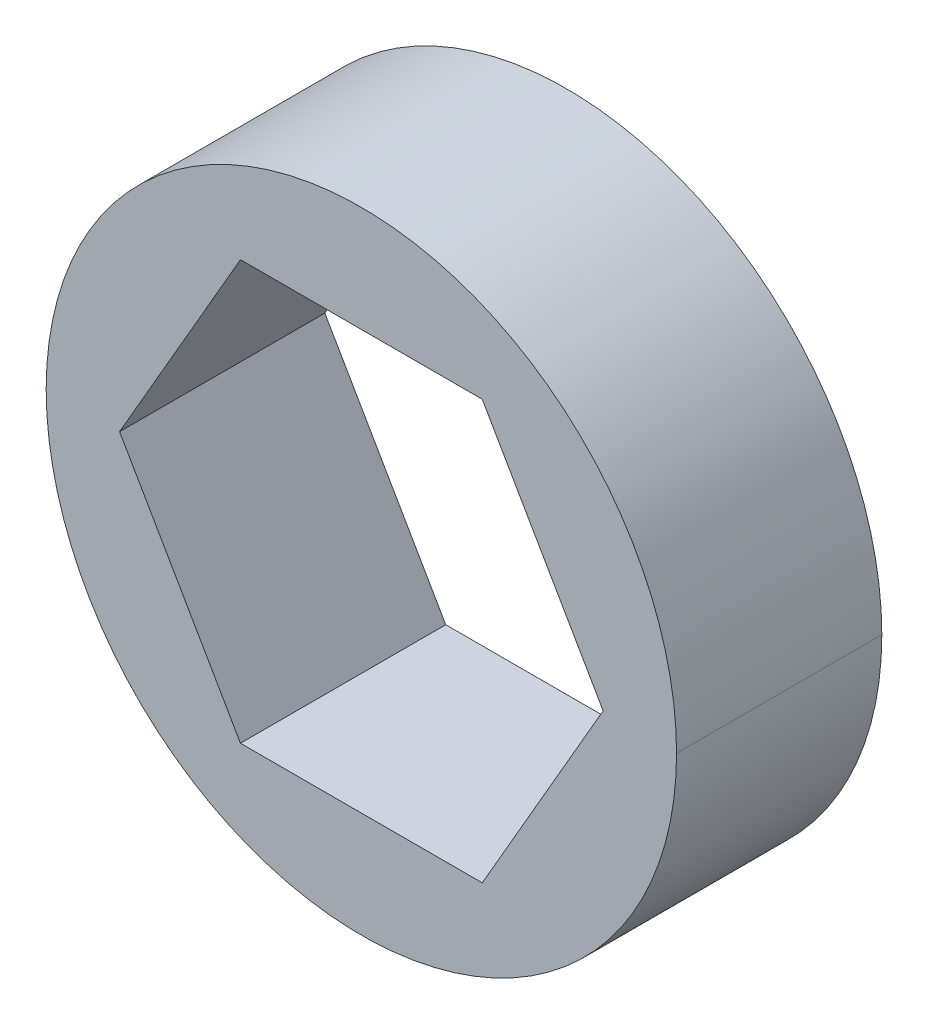
ISO-10303-21;
HEADER;
FILE_DESCRIPTION(('STEP AP214'),'2;1');
FILE_NAME('part.step','',(''),(''),'','','');
FILE_SCHEMA(('AUTOMOTIVE_DESIGN { 1 0 10303 214 1 1 1 1 }'));
ENDSEC;
DATA;
#1=APPLICATION_CONTEXT('core data for automotive mechanical design processes');
#2=APPLICATION_PROTOCOL_DEFINITION('international standard','automotive_design',2000,#1);
#3=PRODUCT_CONTEXT('',#1,'mechanical');
#4=PRODUCT('Part','Part','',(#3));
#5=PRODUCT_RELATED_PRODUCT_CATEGORY('part','',(#4));
#6=PRODUCT_DEFINITION_FORMATION('','',#4);
#7=PRODUCT_DEFINITION_CONTEXT('part definition',#1,'design');
#8=PRODUCT_DEFINITION('design','',#6,#7);
#9=PRODUCT_DEFINITION_SHAPE('','',#8);
#10=(LENGTH_UNIT() NAMED_UNIT(*) SI_UNIT(.MILLI.,.METRE.));
#11=(NAMED_UNIT(*) PLANE_ANGLE_UNIT() SI_UNIT($,.RADIAN.));
#12=(NAMED_UNIT(*) SI_UNIT($,.STERADIAN.) SOLID_ANGLE_UNIT());
#13=UNCERTAINTY_MEASURE_WITH_UNIT(LENGTH_MEASURE(1.E-05),#10,'distance_accuracy_value','');
#14=(GEOMETRIC_REPRESENTATION_CONTEXT(3) GLOBAL_UNCERTAINTY_ASSIGNED_CONTEXT((#13)) GLOBAL_UNIT_ASSIGNED_CONTEXT((#10,
#11,#12)) REPRESENTATION_CONTEXT('',''));
#15=CARTESIAN_POINT('',(0.,0.,0.));
#16=DIRECTION('',(0.,0.,1.));
#17=DIRECTION('',(1.,0.,0.));
#18=AXIS2_PLACEMENT_3D('',#15,#16,#17);
#19=CARTESIAN_POINT('',(-7.47899538708241,0.,3.175));
#20=DIRECTION('',(0.866025403784439,0.5,0.));
#21=DIRECTION('',(0.,0.,-1.));
#22=AXIS2_PLACEMENT_3D('',#19,#20,#21);
#23=PLANE('',#22);
#24=DIRECTION('',(-0.5,0.866025403784439,0.));
#25=VECTOR('',#24,1.);
#26=CARTESIAN_POINT('',(-3.7394976935412,-6.477,3.175));
#27=LINE('',#26,#25);
#28=CARTESIAN_POINT('',(-3.7394976935412,-6.477,3.175));
#29=VERTEX_POINT('',#28);
#30=CARTESIAN_POINT('',(-7.47899538708241,0.,3.175));
#31=VERTEX_POINT('',#30);
#32=EDGE_CURVE('E165',#29,#31,#27,.T.);
#33=ORIENTED_EDGE('',*,*,#32,.F.);
#34=DIRECTION('',(0.,0.,1.));
#35=VECTOR('',#34,1.);
#36=CARTESIAN_POINT('',(-3.73949769354121,-6.477,3.175));
#37=LINE('',#36,#35);
#38=CARTESIAN_POINT('',(-3.7394976935412,-6.477,-3.175));
#39=VERTEX_POINT('',#38);
#40=EDGE_CURVE('E158',#39,#29,#37,.T.);
#41=ORIENTED_EDGE('',*,*,#40,.F.);
#42=DIRECTION('',(-0.5,0.866025403784439,0.));
#43=VECTOR('',#42,1.);
#44=CARTESIAN_POINT('',(-3.73949769354121,-6.477,-3.175));
#45=LINE('',#44,#43);
#46=CARTESIAN_POINT('',(-7.47899538708241,0.,-3.175));
#47=VERTEX_POINT('',#46);
#48=EDGE_CURVE('E177',#39,#47,#45,.T.);
#49=ORIENTED_EDGE('',*,*,#48,.T.);
#50=DIRECTION('',(0.,0.,-1.));
#51=VECTOR('',#50,1.);
#52=CARTESIAN_POINT('',(-7.47899538708241,0.,3.175));
#53=LINE('',#52,#51);
#54=EDGE_CURVE('E11',#31,#47,#53,.T.);
#55=ORIENTED_EDGE('',*,*,#54,.F.);
#56=EDGE_LOOP('',(#33,#41,#49,#55));
#57=FACE_BOUND('',#56,.T.);
#58=ADVANCED_FACE('F16',(#57),#23,.T.);
#59=CARTESIAN_POINT('',(-3.73949769354121,6.477,3.175));
#60=DIRECTION('',(0.866025403784439,-0.5,0.));
#61=DIRECTION('',(0.,0.,-1.));
#62=AXIS2_PLACEMENT_3D('',#59,#60,#61);
#63=PLANE('',#62);
#64=DIRECTION('',(0.5,0.866025403784439,0.));
#65=VECTOR('',#64,1.);
#66=CARTESIAN_POINT('',(-7.47899538708242,0.,3.175));
#67=LINE('',#66,#65);
#68=CARTESIAN_POINT('',(-3.73949769354121,6.477,3.175));
#69=VERTEX_POINT('',#68);
#70=EDGE_CURVE('E164',#31,#69,#67,.T.);
#71=ORIENTED_EDGE('',*,*,#70,.F.);
#72=ORIENTED_EDGE('',*,*,#54,.T.);
#73=DIRECTION('',(0.5,0.866025403784439,0.));
#74=VECTOR('',#73,1.);
#75=CARTESIAN_POINT('',(-7.47899538708241,0.,-3.175));
#76=LINE('',#75,#74);
#77=CARTESIAN_POINT('',(-3.73949769354121,6.477,-3.175));
#78=VERTEX_POINT('',#77);
#79=EDGE_CURVE('E20',#47,#78,#76,.T.);
#80=ORIENTED_EDGE('',*,*,#79,.T.);
#81=DIRECTION('',(0.,0.,-1.));
#82=VECTOR('',#81,1.);
#83=CARTESIAN_POINT('',(-3.73949769354121,6.477,3.175));
#84=LINE('',#83,#82);
#85=EDGE_CURVE('E27',#69,#78,#84,.T.);
#86=ORIENTED_EDGE('',*,*,#85,.F.);
#87=EDGE_LOOP('',(#71,#72,#80,#86));
#88=FACE_BOUND('',#87,.T.);
#89=ADVANCED_FACE('F289',(#88),#63,.T.);
#90=CARTESIAN_POINT('',(3.7394976935412,6.477,3.175));
#91=DIRECTION('',(0.,-1.,0.));
#92=DIRECTION('',(0.,0.,-1.));
#93=AXIS2_PLACEMENT_3D('',#90,#91,#92);
#94=PLANE('',#93);
#95=DIRECTION('',(1.,0.,0.));
#96=VECTOR('',#95,1.);
#97=CARTESIAN_POINT('',(0.,6.477,3.175));
#98=LINE('',#97,#96);
#99=CARTESIAN_POINT('',(3.7394976935412,6.477,3.175));
#100=VERTEX_POINT('',#99);
#101=EDGE_CURVE('E153',#69,#100,#98,.T.);
#102=ORIENTED_EDGE('',*,*,#101,.F.);
#103=ORIENTED_EDGE('',*,*,#85,.T.);
#104=DIRECTION('',(1.,0.,0.));
#105=VECTOR('',#104,1.);
#106=CARTESIAN_POINT('',(0.,6.477,-3.175));
#107=LINE('',#106,#105);
#108=CARTESIAN_POINT('',(3.7394976935412,6.477,-3.175));
#109=VERTEX_POINT('',#108);
#110=EDGE_CURVE('E181',#78,#109,#107,.T.);
#111=ORIENTED_EDGE('',*,*,#110,.T.);
#112=DIRECTION('',(0.,0.,-1.));
#113=VECTOR('',#112,1.);
#114=CARTESIAN_POINT('',(3.7394976935412,6.477,3.175));
#115=LINE('',#114,#113);
#116=EDGE_CURVE('E73',#100,#109,#115,.T.);
#117=ORIENTED_EDGE('',*,*,#116,.F.);
#118=EDGE_LOOP('',(#102,#103,#111,#117));
#119=FACE_BOUND('',#118,.T.);
#120=ADVANCED_FACE('F296',(#119),#94,.T.);
#121=CARTESIAN_POINT('',(7.47899538708241,0.,3.175));
#122=DIRECTION('',(-0.866025403784439,-0.5,0.));
#123=DIRECTION('',(-0.5,0.866025403784439,0.));
#124=AXIS2_PLACEMENT_3D('',#121,#122,#123);
#125=PLANE('',#124);
#126=DIRECTION('',(0.5,-0.866025403784439,0.));
#127=VECTOR('',#126,1.);
#128=CARTESIAN_POINT('',(3.7394976935412,6.477,3.175));
#129=LINE('',#128,#127);
#130=CARTESIAN_POINT('',(7.47899538708242,0.,3.175));
#131=VERTEX_POINT('',#130);
#132=EDGE_CURVE('E148',#100,#131,#129,.T.);
#133=ORIENTED_EDGE('',*,*,#132,.F.);
#134=ORIENTED_EDGE('',*,*,#116,.T.);
#135=DIRECTION('',(0.5,-0.866025403784439,0.));
#136=VECTOR('',#135,1.);
#137=CARTESIAN_POINT('',(3.7394976935412,6.477,-3.175));
#138=LINE('',#137,#136);
#139=CARTESIAN_POINT('',(7.47899538708241,0.,-3.175));
#140=VERTEX_POINT('',#139);
#141=EDGE_CURVE('E183',#109,#140,#138,.T.);
#142=ORIENTED_EDGE('',*,*,#141,.T.);
#143=DIRECTION('',(0.,0.,-1.));
#144=VECTOR('',#143,1.);
#145=CARTESIAN_POINT('',(7.47899538708242,0.,3.175));
#146=LINE('',#145,#144);
#147=EDGE_CURVE('E110',#131,#140,#146,.T.);
#148=ORIENTED_EDGE('',*,*,#147,.F.);
#149=EDGE_LOOP('',(#133,#134,#142,#148));
#150=FACE_BOUND('',#149,.T.);
#151=ADVANCED_FACE('F301',(#150),#125,.T.);
#152=CARTESIAN_POINT('',(3.7394976935412,-6.477,3.175));
#153=DIRECTION('',(-0.866025403784439,0.5,0.));
#154=DIRECTION('',(0.,0.,1.));
#155=AXIS2_PLACEMENT_3D('',#152,#153,#154);
#156=PLANE('',#155);
#157=DIRECTION('',(-0.5,-0.866025403784439,0.));
#158=VECTOR('',#157,1.);
#159=CARTESIAN_POINT('',(7.47899538708241,0.,3.175));
#160=LINE('',#159,#158);
#161=CARTESIAN_POINT('',(3.73949769354121,-6.477,3.175));
#162=VERTEX_POINT('',#161);
#163=EDGE_CURVE('E152',#131,#162,#160,.T.);
#164=ORIENTED_EDGE('',*,*,#163,.F.);
#165=ORIENTED_EDGE('',*,*,#147,.T.);
#166=DIRECTION('',(-0.5,-0.866025403784439,0.));
#167=VECTOR('',#166,1.);
#168=CARTESIAN_POINT('',(7.47899538708241,0.,-3.175));
#169=LINE('',#168,#167);
#170=CARTESIAN_POINT('',(3.73949769354121,-6.477,-3.175));
#171=VERTEX_POINT('',#170);
#172=EDGE_CURVE('E127',#140,#171,#169,.T.);
#173=ORIENTED_EDGE('',*,*,#172,.T.);
#174=DIRECTION('',(0.,0.,-1.));
#175=VECTOR('',#174,1.);
#176=CARTESIAN_POINT('',(3.7394976935412,-6.477,3.175));
#177=LINE('',#176,#175);
#178=EDGE_CURVE('E161',#162,#171,#177,.T.);
#179=ORIENTED_EDGE('',*,*,#178,.F.);
#180=EDGE_LOOP('',(#164,#165,#173,#179));
#181=FACE_BOUND('',#180,.T.);
#182=ADVANCED_FACE('F329',(#181),#156,.T.);
#183=CARTESIAN_POINT('',(-3.7394976935412,-6.477,3.175));
#184=DIRECTION('',(0.,1.,0.));
#185=DIRECTION('',(1.,0.,0.));
#186=AXIS2_PLACEMENT_3D('',#183,#184,#185);
#187=PLANE('',#186);
#188=DIRECTION('',(-1.,0.,0.));
#189=VECTOR('',#188,1.);
#190=CARTESIAN_POINT('',(0.,-6.477,3.175));
#191=LINE('',#190,#189);
#192=EDGE_CURVE('E169',#162,#29,#191,.T.);
#193=ORIENTED_EDGE('',*,*,#192,.F.);
#194=ORIENTED_EDGE('',*,*,#178,.T.);
#195=DIRECTION('',(-1.,0.,0.));
#196=VECTOR('',#195,1.);
#197=CARTESIAN_POINT('',(0.,-6.477,-3.175));
#198=LINE('',#197,#196);
#199=EDGE_CURVE('E157',#171,#39,#198,.T.);
#200=ORIENTED_EDGE('',*,*,#199,.T.);
#201=ORIENTED_EDGE('',*,*,#40,.T.);
#202=EDGE_LOOP('',(#193,#194,#200,#201));
#203=FACE_BOUND('',#202,.T.);
#204=ADVANCED_FACE('F276',(#203),#187,.T.);
#205=CARTESIAN_POINT('',(0.,0.,3.175));
#206=DIRECTION('',(0.,0.,1.));
#207=DIRECTION('',(1.,0.,0.));
#208=AXIS2_PLACEMENT_3D('',#205,#206,#207);
#209=PLANE('',#208);
#210=ORIENTED_EDGE('',*,*,#101,.T.);
#211=ORIENTED_EDGE('',*,*,#132,.T.);
#212=ORIENTED_EDGE('',*,*,#163,.T.);
#213=ORIENTED_EDGE('',*,*,#192,.T.);
#214=ORIENTED_EDGE('',*,*,#32,.T.);
#215=ORIENTED_EDGE('',*,*,#70,.T.);
#216=EDGE_LOOP('',(#210,#211,#212,#213,#214,#215));
#217=FACE_BOUND('',#216,.T.);
#218=CARTESIAN_POINT('',(0.,0.,3.175));
#219=DIRECTION('',(0.,0.,-1.));
#220=DIRECTION('',(-1.,0.,0.));
#221=AXIS2_PLACEMENT_3D('',#218,#219,#220);
#222=CIRCLE('',#221,9.75);
#223=CARTESIAN_POINT('',(-9.75,0.,3.175));
#224=VERTEX_POINT('',#223);
#225=CARTESIAN_POINT('',(9.75,0.,3.175));
#226=VERTEX_POINT('',#225);
#227=EDGE_CURVE('E146',#224,#226,#222,.T.);
#228=ORIENTED_EDGE('',*,*,#227,.F.);
#229=CARTESIAN_POINT('',(0.,0.,3.175));
#230=DIRECTION('',(0.,0.,-1.));
#231=DIRECTION('',(-1.,0.,0.));
#232=AXIS2_PLACEMENT_3D('',#229,#230,#231);
#233=CIRCLE('',#232,9.75);
#234=EDGE_CURVE('E128',#226,#224,#233,.T.);
#235=ORIENTED_EDGE('',*,*,#234,.F.);
#236=EDGE_LOOP('',(#228,#235));
#237=FACE_BOUND('',#236,.T.);
#238=ADVANCED_FACE('F271',(#217,#237),#209,.T.);
#239=CARTESIAN_POINT('',(0.,0.,-3.175));
#240=DIRECTION('',(0.,0.,1.));
#241=DIRECTION('',(1.,0.,0.));
#242=AXIS2_PLACEMENT_3D('',#239,#240,#241);
#243=PLANE('',#242);
#244=ORIENTED_EDGE('',*,*,#172,.F.);
#245=ORIENTED_EDGE('',*,*,#141,.F.);
#246=ORIENTED_EDGE('',*,*,#110,.F.);
#247=ORIENTED_EDGE('',*,*,#79,.F.);
#248=ORIENTED_EDGE('',*,*,#48,.F.);
#249=ORIENTED_EDGE('',*,*,#199,.F.);
#250=EDGE_LOOP('',(#244,#245,#246,#247,#248,#249));
#251=FACE_BOUND('',#250,.T.);
#252=CARTESIAN_POINT('',(0.,0.,-3.175));
#253=DIRECTION('',(0.,0.,1.));
#254=DIRECTION('',(-1.,0.,0.));
#255=AXIS2_PLACEMENT_3D('',#252,#253,#254);
#256=CIRCLE('',#255,9.75);
#257=CARTESIAN_POINT('',(-9.75,0.,-3.175));
#258=VERTEX_POINT('',#257);
#259=CARTESIAN_POINT('',(9.75,0.,-3.175));
#260=VERTEX_POINT('',#259);
#261=EDGE_CURVE('E119',#258,#260,#256,.T.);
#262=ORIENTED_EDGE('',*,*,#261,.F.);
#263=CARTESIAN_POINT('',(0.,0.,-3.175));
#264=DIRECTION('',(0.,0.,1.));
#265=DIRECTION('',(-1.,0.,0.));
#266=AXIS2_PLACEMENT_3D('',#263,#264,#265);
#267=CIRCLE('',#266,9.75);
#268=EDGE_CURVE('E122',#260,#258,#267,.T.);
#269=ORIENTED_EDGE('',*,*,#268,.F.);
#270=EDGE_LOOP('',(#262,#269));
#271=FACE_BOUND('',#270,.T.);
#272=ADVANCED_FACE('F18',(#251,#271),#243,.F.);
#273=CARTESIAN_POINT('',(0.,0.,3.175));
#274=DIRECTION('',(0.,0.,-1.));
#275=DIRECTION('',(-1.,0.,0.));
#276=AXIS2_PLACEMENT_3D('',#273,#274,#275);
#277=CYLINDRICAL_SURFACE('',#276,9.75);
#278=DIRECTION('',(0.,0.,-1.));
#279=VECTOR('',#278,1.);
#280=CARTESIAN_POINT('',(9.75,0.,3.175));
#281=LINE('',#280,#279);
#282=EDGE_CURVE('E139',#226,#260,#281,.T.);
#283=ORIENTED_EDGE('',*,*,#282,.F.);
#284=ORIENTED_EDGE('',*,*,#234,.T.);
#285=DIRECTION('',(0.,0.,-1.));
#286=VECTOR('',#285,1.);
#287=CARTESIAN_POINT('',(-9.75,0.,3.175));
#288=LINE('',#287,#286);
#289=EDGE_CURVE('E131',#224,#258,#288,.T.);
#290=ORIENTED_EDGE('',*,*,#289,.T.);
#291=ORIENTED_EDGE('',*,*,#261,.T.);
#292=EDGE_LOOP('',(#283,#284,#290,#291));
#293=FACE_BOUND('',#292,.T.);
#294=ADVANCED_FACE('F132',(#293),#277,.T.);
#295=CARTESIAN_POINT('',(0.,0.,3.175));
#296=DIRECTION('',(0.,0.,-1.));
#297=DIRECTION('',(-1.,0.,0.));
#298=AXIS2_PLACEMENT_3D('',#295,#296,#297);
#299=CYLINDRICAL_SURFACE('',#298,9.75);
#300=ORIENTED_EDGE('',*,*,#227,.T.);
#301=ORIENTED_EDGE('',*,*,#282,.T.);
#302=ORIENTED_EDGE('',*,*,#268,.T.);
#303=ORIENTED_EDGE('',*,*,#289,.F.);
#304=EDGE_LOOP('',(#300,#301,#302,#303));
#305=FACE_BOUND('',#304,.T.);
#306=ADVANCED_FACE('F138',(#305),#299,.T.);
#307=CLOSED_SHELL('',(#58,#89,#120,#151,#182,#204,#238,#272,#294,#306));
#308=MANIFOLD_SOLID_BREP('B1',#307);
#309=ADVANCED_BREP_SHAPE_REPRESENTATION('',(#18,#308),#14);
#310=SHAPE_DEFINITION_REPRESENTATION(#9,#309);
ENDSEC;
END-ISO-10303-21;
